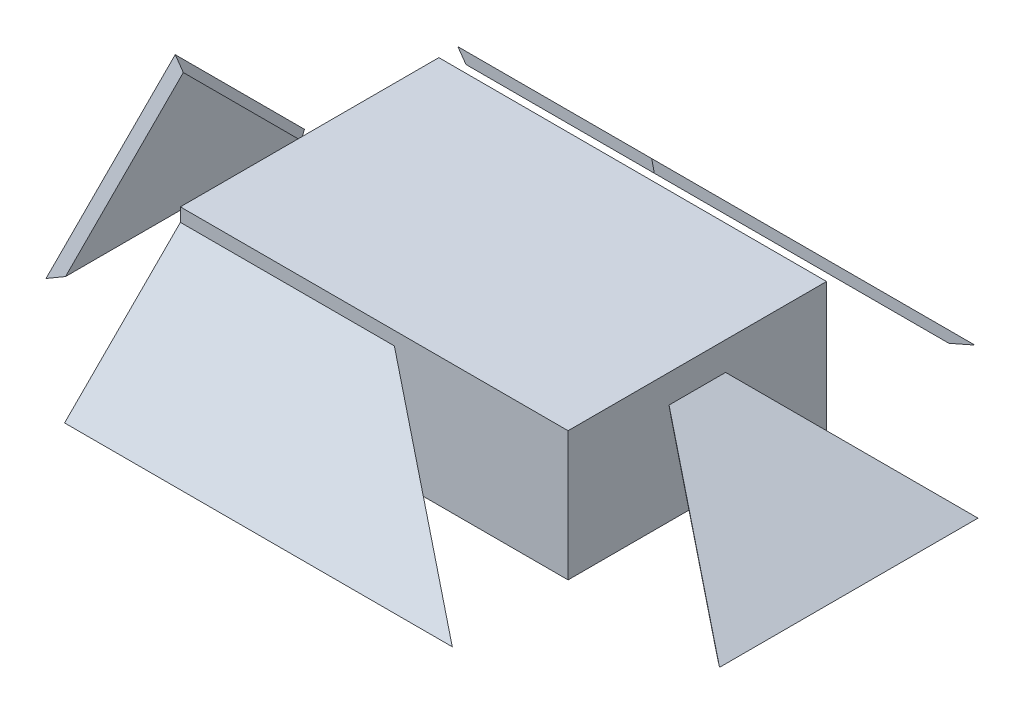
ISO-10303-21;
HEADER;
FILE_DESCRIPTION(('STEP AP214'),'2;1');
FILE_NAME('part.step','',(''),(''),'','','');
FILE_SCHEMA(('AUTOMOTIVE_DESIGN { 1 0 10303 214 1 1 1 1 }'));
ENDSEC;
DATA;
#1=APPLICATION_CONTEXT('core data for automotive mechanical design processes');
#2=APPLICATION_PROTOCOL_DEFINITION('international standard','automotive_design',2000,#1);
#3=PRODUCT_CONTEXT('',#1,'mechanical');
#4=PRODUCT('Part','Part','',(#3));
#5=PRODUCT_RELATED_PRODUCT_CATEGORY('part','',(#4));
#6=PRODUCT_DEFINITION_FORMATION('','',#4);
#7=PRODUCT_DEFINITION_CONTEXT('part definition',#1,'design');
#8=PRODUCT_DEFINITION('design','',#6,#7);
#9=PRODUCT_DEFINITION_SHAPE('','',#8);
#10=(LENGTH_UNIT() NAMED_UNIT(*) SI_UNIT(.MILLI.,.METRE.));
#11=(NAMED_UNIT(*) PLANE_ANGLE_UNIT() SI_UNIT($,.RADIAN.));
#12=(NAMED_UNIT(*) SI_UNIT($,.STERADIAN.) SOLID_ANGLE_UNIT());
#13=UNCERTAINTY_MEASURE_WITH_UNIT(LENGTH_MEASURE(1.E-05),#10,'distance_accuracy_value','');
#14=(GEOMETRIC_REPRESENTATION_CONTEXT(3) GLOBAL_UNCERTAINTY_ASSIGNED_CONTEXT((#13)) GLOBAL_UNIT_ASSIGNED_CONTEXT((#10,
#11,#12)) REPRESENTATION_CONTEXT('',''));
#15=CARTESIAN_POINT('',(0.,0.,0.));
#16=DIRECTION('',(0.,0.,1.));
#17=DIRECTION('',(1.,0.,0.));
#18=AXIS2_PLACEMENT_3D('',#15,#16,#17);
#19=CARTESIAN_POINT('',(67.8643239032383,-12.7,25.4));
#20=DIRECTION('',(-0.554700196225229,-0.832050294337843,0.));
#21=DIRECTION('',(-0.727606875108999,0.485071250072666,-0.485071250072666));
#22=AXIS2_PLACEMENT_3D('',#19,#20,#21);
#23=PLANE('',#22);
#24=DIRECTION('',(-0.727606875108999,0.485071250072666,-0.485071250072666));
#25=VECTOR('',#24,1.);
#26=CARTESIAN_POINT('',(67.8643239032383,-12.7,25.4));
#27=LINE('',#26,#25);
#28=CARTESIAN_POINT('',(67.8643239032383,-12.7,25.4));
#29=VERTEX_POINT('',#28);
#30=CARTESIAN_POINT('',(29.7643239032383,12.7,0.));
#31=VERTEX_POINT('',#30);
#32=EDGE_CURVE('E112',#29,#31,#27,.T.);
#33=ORIENTED_EDGE('',*,*,#32,.F.);
#34=DIRECTION('',(0.,0.,1.));
#35=VECTOR('',#34,1.);
#36=CARTESIAN_POINT('',(67.8643239032383,-12.7,0.));
#37=LINE('',#36,#35);
#38=CARTESIAN_POINT('',(67.8643239032383,-12.7,-25.4));
#39=VERTEX_POINT('',#38);
#40=EDGE_CURVE('E113',#39,#29,#37,.T.);
#41=ORIENTED_EDGE('',*,*,#40,.F.);
#42=DIRECTION('',(0.727606875108999,-0.485071250072666,-0.485071250072666));
#43=VECTOR('',#42,1.);
#44=CARTESIAN_POINT('',(29.7643239032383,12.7,0.));
#45=LINE('',#44,#43);
#46=EDGE_CURVE('E109',#31,#39,#45,.T.);
#47=ORIENTED_EDGE('',*,*,#46,.F.);
#48=EDGE_LOOP('',(#33,#41,#47));
#49=FACE_BOUND('',#48,.T.);
#50=ADVANCED_FACE('F71',(#49),#23,.F.);
#51=CARTESIAN_POINT('',(66.9837373417308,-14.0208798422613,25.4));
#52=DIRECTION('',(-0.554700196225229,-0.832050294337843,0.));
#53=DIRECTION('',(-0.727606875108999,0.485071250072666,-0.485071250072666));
#54=AXIS2_PLACEMENT_3D('',#51,#52,#53);
#55=PLANE('',#54);
#56=DIRECTION('',(-0.727606875108999,0.485071250072666,-0.485071250072666));
#57=VECTOR('',#56,1.);
#58=CARTESIAN_POINT('',(-8.89008000367885,36.5616650546785,-26.1067290849458));
#59=LINE('',#58,#57);
#60=CARTESIAN_POINT('',(65.0024175783388,-12.7,23.1549359697327));
#61=VERTEX_POINT('',#60);
#62=CARTESIAN_POINT('',(30.2700136237397,10.4549359697327,0.));
#63=VERTEX_POINT('',#62);
#64=EDGE_CURVE('E143',#61,#63,#59,.T.);
#65=ORIENTED_EDGE('',*,*,#64,.T.);
#66=DIRECTION('',(0.727606875108999,-0.485071250072666,-0.485071250072666));
#67=VECTOR('',#66,1.);
#68=CARTESIAN_POINT('',(49.3805082316152,-2.28539376885095,-12.7403297385837));
#69=LINE('',#68,#67);
#70=CARTESIAN_POINT('',(65.0024175783388,-12.7,-23.1549359697327));
#71=VERTEX_POINT('',#70);
#72=EDGE_CURVE('E82',#63,#71,#69,.T.);
#73=ORIENTED_EDGE('',*,*,#72,.T.);
#74=DIRECTION('',(0.,0.,1.));
#75=VECTOR('',#74,1.);
#76=CARTESIAN_POINT('',(65.0024175783388,-12.7,-25.4));
#77=LINE('',#76,#75);
#78=EDGE_CURVE('E13',#71,#61,#77,.T.);
#79=ORIENTED_EDGE('',*,*,#78,.T.);
#80=EDGE_LOOP('',(#65,#73,#79));
#81=FACE_BOUND('',#80,.T.);
#82=ADVANCED_FACE('F189',(#81),#55,.T.);
#83=CARTESIAN_POINT('',(35.4855499919242,-12.7000000000001,0.));
#84=DIRECTION('',(0.,-1.,0.));
#85=DIRECTION('',(0.,0.,-1.));
#86=AXIS2_PLACEMENT_3D('',#83,#84,#85);
#87=PLANE('',#86);
#88=DIRECTION('',(0.786795792469444,0.,-0.617213399848367));
#89=VECTOR('',#88,1.);
#90=CARTESIAN_POINT('',(65.0024175783388,-12.7,-23.1549359697327));
#91=LINE('',#90,#89);
#92=EDGE_CURVE('E103',#71,#39,#91,.T.);
#93=ORIENTED_EDGE('',*,*,#92,.T.);
#94=ORIENTED_EDGE('',*,*,#40,.T.);
#95=DIRECTION('',(0.786795792469442,0.,0.617213399848369));
#96=VECTOR('',#95,1.);
#97=CARTESIAN_POINT('',(65.0024175783388,-12.7,23.1549359697327));
#98=LINE('',#97,#96);
#99=EDGE_CURVE('E128',#61,#29,#98,.T.);
#100=ORIENTED_EDGE('',*,*,#99,.F.);
#101=ORIENTED_EDGE('',*,*,#78,.F.);
#102=EDGE_LOOP('',(#93,#94,#100,#101));
#103=FACE_BOUND('',#102,.T.);
#104=ADVANCED_FACE('F155',(#103),#87,.T.);
#105=CARTESIAN_POINT('',(35.4855499919244,-12.7,0.));
#106=DIRECTION('',(-0.611333817621871,-0.13769996008954,0.77930076634327));
#107=DIRECTION('',(0.786795792469442,0.,0.617213399848369));
#108=AXIS2_PLACEMENT_3D('',#105,#106,#107);
#109=PLANE('',#108);
#110=ORIENTED_EDGE('',*,*,#99,.T.);
#111=ORIENTED_EDGE('',*,*,#32,.T.);
#112=DIRECTION('',(-0.219739796968774,0.975558517787694,0.));
#113=VECTOR('',#112,1.);
#114=CARTESIAN_POINT('',(30.2700136237397,10.4549359697327,0.));
#115=LINE('',#114,#113);
#116=EDGE_CURVE('E118',#63,#31,#115,.T.);
#117=ORIENTED_EDGE('',*,*,#116,.F.);
#118=ORIENTED_EDGE('',*,*,#64,.F.);
#119=EDGE_LOOP('',(#110,#111,#117,#118));
#120=FACE_BOUND('',#119,.T.);
#121=ADVANCED_FACE('F126',(#120),#109,.T.);
#122=CARTESIAN_POINT('',(35.4855499919243,-12.6999999999999,-1.28369537222284E-13));
#123=DIRECTION('',(-0.61133381762187,-0.137699960089538,-0.779300766343272));
#124=DIRECTION('',(-0.786795792469443,0.,0.617213399848368));
#125=AXIS2_PLACEMENT_3D('',#122,#123,#124);
#126=PLANE('',#125);
#127=ORIENTED_EDGE('',*,*,#116,.T.);
#128=ORIENTED_EDGE('',*,*,#46,.T.);
#129=ORIENTED_EDGE('',*,*,#92,.F.);
#130=ORIENTED_EDGE('',*,*,#72,.F.);
#131=EDGE_LOOP('',(#127,#128,#129,#130));
#132=FACE_BOUND('',#131,.T.);
#133=ADVANCED_FACE('F132',(#132),#126,.T.);
#134=CLOSED_SHELL('',(#50,#82,#104,#121,#133));
#135=MANIFOLD_SOLID_BREP('B2',#134);
#136=CARTESIAN_POINT('',(-62.9212351803004,12.7,0.));
#137=DIRECTION('',(-1.,0.,0.));
#138=DIRECTION('',(0.,-0.707106781186547,-0.707106781186547));
#139=AXIS2_PLACEMENT_3D('',#136,#137,#138);
#140=PLANE('',#139);
#141=DIRECTION('',(0.,-0.707106781186548,-0.707106781186548));
#142=VECTOR('',#141,1.);
#143=CARTESIAN_POINT('',(-62.9212351803004,11.5774679848664,1.12253201513364));
#144=LINE('',#143,#142);
#145=CARTESIAN_POINT('',(-62.9212351803004,10.4549359697327,0.));
#146=VERTEX_POINT('',#145);
#147=CARTESIAN_POINT('',(-62.9212351803004,-12.7,-23.1549359697327));
#148=VERTEX_POINT('',#147);
#149=EDGE_CURVE('E357',#146,#148,#144,.T.);
#150=ORIENTED_EDGE('',*,*,#149,.F.);
#151=DIRECTION('',(0.,0.707106781186548,-0.707106781186548));
#152=VECTOR('',#151,1.);
#153=CARTESIAN_POINT('',(-62.9212351803004,36.9774679848664,-26.5225320151336));
#154=LINE('',#153,#152);
#155=CARTESIAN_POINT('',(-62.9212351803003,-12.7,23.1549359697327));
#156=VERTEX_POINT('',#155);
#157=EDGE_CURVE('E358',#156,#146,#154,.T.);
#158=ORIENTED_EDGE('',*,*,#157,.F.);
#159=DIRECTION('',(0.,0.,1.));
#160=VECTOR('',#159,1.);
#161=CARTESIAN_POINT('',(-62.9212351803004,-12.7,-25.4));
#162=LINE('',#161,#160);
#163=EDGE_CURVE('E354',#148,#156,#162,.T.);
#164=ORIENTED_EDGE('',*,*,#163,.F.);
#165=EDGE_LOOP('',(#150,#158,#164));
#166=FACE_BOUND('',#165,.T.);
#167=ADVANCED_FACE('F316',(#166),#140,.F.);
#168=CARTESIAN_POINT('',(-64.5087351803003,12.7,0.));
#169=DIRECTION('',(-1.,0.,0.));
#170=DIRECTION('',(0.,-0.707106781186547,-0.707106781186547));
#171=AXIS2_PLACEMENT_3D('',#168,#169,#170);
#172=PLANE('',#171);
#173=DIRECTION('',(0.,-0.707106781186548,-0.707106781186547));
#174=VECTOR('',#173,1.);
#175=CARTESIAN_POINT('',(-64.5087351803003,0.,-12.7));
#176=LINE('',#175,#174);
#177=CARTESIAN_POINT('',(-64.5087351803003,12.7,0.));
#178=VERTEX_POINT('',#177);
#179=CARTESIAN_POINT('',(-64.5087351803003,-12.7,-25.4));
#180=VERTEX_POINT('',#179);
#181=EDGE_CURVE('E379',#178,#180,#176,.T.);
#182=ORIENTED_EDGE('',*,*,#181,.T.);
#183=DIRECTION('',(0.,0.,1.));
#184=VECTOR('',#183,1.);
#185=CARTESIAN_POINT('',(-64.5087351803003,-12.7,0.));
#186=LINE('',#185,#184);
#187=CARTESIAN_POINT('',(-64.5087351803003,-12.7,25.4));
#188=VERTEX_POINT('',#187);
#189=EDGE_CURVE('E327',#180,#188,#186,.T.);
#190=ORIENTED_EDGE('',*,*,#189,.T.);
#191=DIRECTION('',(0.,0.707106781186547,-0.707106781186547));
#192=VECTOR('',#191,1.);
#193=CARTESIAN_POINT('',(-64.5087351803003,-12.7,25.4));
#194=LINE('',#193,#192);
#195=EDGE_CURVE('E69',#188,#178,#194,.T.);
#196=ORIENTED_EDGE('',*,*,#195,.T.);
#197=EDGE_LOOP('',(#182,#190,#196));
#198=FACE_BOUND('',#197,.T.);
#199=ADVANCED_FACE('F402',(#198),#172,.T.);
#200=CARTESIAN_POINT('',(-46.5482229381621,-12.6999999999999,0.));
#201=DIRECTION('',(-0.707106781186547,-0.500000000000001,0.5));
#202=DIRECTION('',(0.577350269189626,-0.816496580927725,0.));
#203=AXIS2_PLACEMENT_3D('',#200,#201,#202);
#204=PLANE('',#203);
#205=DIRECTION('',(0.577350269189626,-0.816496580927726,0.));
#206=VECTOR('',#205,1.);
#207=CARTESIAN_POINT('',(-64.5087351803003,12.7,0.));
#208=LINE('',#207,#206);
#209=EDGE_CURVE('E373',#178,#146,#208,.T.);
#210=ORIENTED_EDGE('',*,*,#209,.T.);
#211=ORIENTED_EDGE('',*,*,#149,.T.);
#212=DIRECTION('',(0.577350269189625,0.,0.816496580927726));
#213=VECTOR('',#212,1.);
#214=CARTESIAN_POINT('',(-64.5087351803003,-12.7,-25.4));
#215=LINE('',#214,#213);
#216=EDGE_CURVE('E371',#180,#148,#215,.T.);
#217=ORIENTED_EDGE('',*,*,#216,.F.);
#218=ORIENTED_EDGE('',*,*,#181,.F.);
#219=EDGE_LOOP('',(#210,#211,#217,#218));
#220=FACE_BOUND('',#219,.T.);
#221=ADVANCED_FACE('F370',(#220),#204,.F.);
#222=CARTESIAN_POINT('',(-46.5482229381618,-12.7,3.53883589099269E-13));
#223=DIRECTION('',(0.,1.,0.));
#224=DIRECTION('',(-1.,0.,0.));
#225=AXIS2_PLACEMENT_3D('',#222,#223,#224);
#226=PLANE('',#225);
#227=ORIENTED_EDGE('',*,*,#216,.T.);
#228=ORIENTED_EDGE('',*,*,#163,.T.);
#229=DIRECTION('',(0.577350269189636,0.,-0.816496580927719));
#230=VECTOR('',#229,1.);
#231=CARTESIAN_POINT('',(-64.5087351803003,-12.7,25.4));
#232=LINE('',#231,#230);
#233=EDGE_CURVE('E348',#188,#156,#232,.T.);
#234=ORIENTED_EDGE('',*,*,#233,.F.);
#235=ORIENTED_EDGE('',*,*,#189,.F.);
#236=EDGE_LOOP('',(#227,#228,#234,#235));
#237=FACE_BOUND('',#236,.T.);
#238=ADVANCED_FACE('F377',(#237),#226,.F.);
#239=CARTESIAN_POINT('',(-46.5482229381619,-12.7000000000002,0.));
#240=DIRECTION('',(-0.707106781186543,-0.499999999999997,-0.50000000000001));
#241=DIRECTION('',(-0.577350269189636,0.,0.816496580927719));
#242=AXIS2_PLACEMENT_3D('',#239,#240,#241);
#243=PLANE('',#242);
#244=ORIENTED_EDGE('',*,*,#233,.T.);
#245=ORIENTED_EDGE('',*,*,#157,.T.);
#246=ORIENTED_EDGE('',*,*,#209,.F.);
#247=ORIENTED_EDGE('',*,*,#195,.F.);
#248=EDGE_LOOP('',(#244,#245,#246,#247));
#249=FACE_BOUND('',#248,.T.);
#250=ADVANCED_FACE('F420',(#249),#243,.F.);
#251=CLOSED_SHELL('',(#167,#199,#221,#238,#250));
#252=MANIFOLD_SOLID_BREP('B7',#251);
#253=CARTESIAN_POINT('',(-38.1,-12.7,-54.5417582925164));
#254=DIRECTION('',(0.,0.707106781186547,-0.707106781186547));
#255=DIRECTION('',(0.,0.707106781186548,0.707106781186548));
#256=AXIS2_PLACEMENT_3D('',#253,#254,#255);
#257=PLANE('',#256);
#258=DIRECTION('',(0.,-0.707106781186548,-0.707106781186547));
#259=VECTOR('',#258,1.);
#260=CARTESIAN_POINT('',(-38.1,0.,-41.8417582925164));
#261=LINE('',#260,#259);
#262=CARTESIAN_POINT('',(-38.1,12.7,-29.1417582925164));
#263=VERTEX_POINT('',#262);
#264=CARTESIAN_POINT('',(-38.1,-12.7,-54.5417582925164));
#265=VERTEX_POINT('',#264);
#266=EDGE_CURVE('E610',#263,#265,#261,.T.);
#267=ORIENTED_EDGE('',*,*,#266,.F.);
#268=DIRECTION('',(1.,0.,0.));
#269=VECTOR('',#268,1.);
#270=CARTESIAN_POINT('',(-38.1,12.7,-29.1417582925164));
#271=LINE('',#270,#269);
#272=CARTESIAN_POINT('',(0.,12.7,-29.1417582925164));
#273=VERTEX_POINT('',#272);
#274=EDGE_CURVE('E628',#263,#273,#271,.T.);
#275=ORIENTED_EDGE('',*,*,#274,.T.);
#276=DIRECTION('',(0.727606875108999,-0.485071250072666,-0.485071250072666));
#277=VECTOR('',#276,1.);
#278=CARTESIAN_POINT('',(0.,12.7,-29.1417582925164));
#279=LINE('',#278,#277);
#280=CARTESIAN_POINT('',(38.1,-12.7,-54.5417582925164));
#281=VERTEX_POINT('',#280);
#282=EDGE_CURVE('E611',#273,#281,#279,.T.);
#283=ORIENTED_EDGE('',*,*,#282,.T.);
#284=DIRECTION('',(-1.,0.,0.));
#285=VECTOR('',#284,1.);
#286=CARTESIAN_POINT('',(-38.1,-12.7,-54.5417582925164));
#287=LINE('',#286,#285);
#288=EDGE_CURVE('E606',#281,#265,#287,.T.);
#289=ORIENTED_EDGE('',*,*,#288,.T.);
#290=EDGE_LOOP('',(#267,#275,#283,#289));
#291=FACE_BOUND('',#290,.T.);
#292=ADVANCED_FACE('F561',(#291),#257,.T.);
#293=CARTESIAN_POINT('',(-38.1,-13.8225320151336,-53.4192262773827));
#294=DIRECTION('',(0.,0.707106781186547,-0.707106781186547));
#295=DIRECTION('',(0.,0.707106781186548,0.707106781186548));
#296=AXIS2_PLACEMENT_3D('',#293,#294,#295);
#297=PLANE('',#296);
#298=DIRECTION('',(0.,-0.707106781186548,-0.707106781186548));
#299=VECTOR('',#298,1.);
#300=CARTESIAN_POINT('',(-36.5125,11.5774679848664,-28.0192262773827));
#301=LINE('',#300,#299);
#302=CARTESIAN_POINT('',(-36.5125,10.4549359697327,-29.1417582925164));
#303=VERTEX_POINT('',#302);
#304=CARTESIAN_POINT('',(-36.5125,-12.7,-52.2966942622491));
#305=VERTEX_POINT('',#304);
#306=EDGE_CURVE('E637',#303,#305,#301,.T.);
#307=ORIENTED_EDGE('',*,*,#306,.T.);
#308=DIRECTION('',(-1.,0.,0.));
#309=VECTOR('',#308,1.);
#310=CARTESIAN_POINT('',(-38.1,-12.7,-52.2966942622491));
#311=LINE('',#310,#309);
#312=CARTESIAN_POINT('',(35.2380936751004,-12.7,-52.2966942622491));
#313=VERTEX_POINT('',#312);
#314=EDGE_CURVE('E634',#313,#305,#311,.T.);
#315=ORIENTED_EDGE('',*,*,#314,.F.);
#316=DIRECTION('',(0.727606875108999,-0.485071250072666,-0.485071250072666));
#317=VECTOR('',#316,1.);
#318=CARTESIAN_POINT('',(19.6161843283769,-2.28539376885095,-41.8820880311));
#319=LINE('',#318,#317);
#320=CARTESIAN_POINT('',(0.505689720501403,10.4549359697327,-29.1417582925164));
#321=VERTEX_POINT('',#320);
#322=EDGE_CURVE('E572',#321,#313,#319,.T.);
#323=ORIENTED_EDGE('',*,*,#322,.F.);
#324=DIRECTION('',(1.,0.,0.));
#325=VECTOR('',#324,1.);
#326=CARTESIAN_POINT('',(-38.1,10.4549359697327,-29.1417582925164));
#327=LINE('',#326,#325);
#328=EDGE_CURVE('E314',#303,#321,#327,.T.);
#329=ORIENTED_EDGE('',*,*,#328,.F.);
#330=EDGE_LOOP('',(#307,#315,#323,#329));
#331=FACE_BOUND('',#330,.T.);
#332=ADVANCED_FACE('F705',(#331),#297,.F.);
#333=CARTESIAN_POINT('',(-10.9126650688098,-12.6999999999998,-16.0930605080474));
#334=DIRECTION('',(0.,-1.,0.));
#335=DIRECTION('',(0.,0.,-1.));
#336=AXIS2_PLACEMENT_3D('',#333,#334,#335);
#337=PLANE('',#336);
#338=DIRECTION('',(-0.577350269189625,0.,-0.816496580927726));
#339=VECTOR('',#338,1.);
#340=CARTESIAN_POINT('',(-36.5125,-12.7,-52.2966942622491));
#341=LINE('',#340,#339);
#342=EDGE_CURVE('E625',#305,#265,#341,.T.);
#343=ORIENTED_EDGE('',*,*,#342,.T.);
#344=ORIENTED_EDGE('',*,*,#288,.F.);
#345=DIRECTION('',(0.786795792469444,0.,-0.617213399848367));
#346=VECTOR('',#345,1.);
#347=CARTESIAN_POINT('',(35.2380936751004,-12.7,-52.2966942622491));
#348=LINE('',#347,#346);
#349=EDGE_CURVE('E600',#313,#281,#348,.T.);
#350=ORIENTED_EDGE('',*,*,#349,.F.);
#351=ORIENTED_EDGE('',*,*,#314,.T.);
#352=EDGE_LOOP('',(#343,#344,#350,#351));
#353=FACE_BOUND('',#352,.T.);
#354=ADVANCED_FACE('F632',(#353),#337,.T.);
#355=CARTESIAN_POINT('',(5.72122608868601,-12.6999999999999,-29.1417582925164));
#356=DIRECTION('',(0.61133381762187,0.137699960089538,0.779300766343272));
#357=DIRECTION('',(0.786795792469443,0.,-0.617213399848368));
#358=AXIS2_PLACEMENT_3D('',#355,#356,#357);
#359=PLANE('',#358);
#360=ORIENTED_EDGE('',*,*,#349,.T.);
#361=ORIENTED_EDGE('',*,*,#282,.F.);
#362=DIRECTION('',(-0.219739796968774,0.975558517787694,0.));
#363=VECTOR('',#362,1.);
#364=CARTESIAN_POINT('',(0.505689720501403,10.4549359697327,-29.1417582925164));
#365=LINE('',#364,#363);
#366=EDGE_CURVE('E616',#321,#273,#365,.T.);
#367=ORIENTED_EDGE('',*,*,#366,.F.);
#368=ORIENTED_EDGE('',*,*,#322,.T.);
#369=EDGE_LOOP('',(#360,#361,#367,#368));
#370=FACE_BOUND('',#369,.T.);
#371=ADVANCED_FACE('F660',(#370),#359,.T.);
#372=CARTESIAN_POINT('',(-20.1394877578617,-12.6999999999999,-29.1417582925164));
#373=DIRECTION('',(-0.707106781186547,-0.500000000000001,0.5));
#374=DIRECTION('',(0.577350269189626,-0.816496580927725,0.));
#375=AXIS2_PLACEMENT_3D('',#372,#373,#374);
#376=PLANE('',#375);
#377=DIRECTION('',(-0.577350269189626,0.816496580927726,0.));
#378=VECTOR('',#377,1.);
#379=CARTESIAN_POINT('',(-36.5125,10.4549359697327,-29.1417582925164));
#380=LINE('',#379,#378);
#381=EDGE_CURVE('E627',#303,#263,#380,.T.);
#382=ORIENTED_EDGE('',*,*,#381,.T.);
#383=ORIENTED_EDGE('',*,*,#266,.T.);
#384=ORIENTED_EDGE('',*,*,#342,.F.);
#385=ORIENTED_EDGE('',*,*,#306,.F.);
#386=EDGE_LOOP('',(#382,#383,#384,#385));
#387=FACE_BOUND('',#386,.T.);
#388=ADVANCED_FACE('F624',(#387),#376,.T.);
#389=CARTESIAN_POINT('',(0.,12.7,-29.1417582925164));
#390=DIRECTION('',(0.,0.,-1.));
#391=DIRECTION('',(0.,1.,0.));
#392=AXIS2_PLACEMENT_3D('',#389,#390,#391);
#393=PLANE('',#392);
#394=ORIENTED_EDGE('',*,*,#366,.T.);
#395=ORIENTED_EDGE('',*,*,#274,.F.);
#396=ORIENTED_EDGE('',*,*,#381,.F.);
#397=ORIENTED_EDGE('',*,*,#328,.T.);
#398=EDGE_LOOP('',(#394,#395,#396,#397));
#399=FACE_BOUND('',#398,.T.);
#400=ADVANCED_FACE('F659',(#399),#393,.F.);
#401=CLOSED_SHELL('',(#292,#332,#354,#371,#388,#400));
#402=MANIFOLD_SOLID_BREP('B63',#401);
#403=CARTESIAN_POINT('',(-38.1,38.1,-2.64020842985895));
#404=DIRECTION('',(0.,-0.707106781186548,-0.707106781186548));
#405=DIRECTION('',(0.,0.707106781186548,-0.707106781186548));
#406=AXIS2_PLACEMENT_3D('',#403,#404,#405);
#407=PLANE('',#406);
#408=DIRECTION('',(-0.727606875108999,0.485071250072666,-0.485071250072666));
#409=VECTOR('',#408,1.);
#410=CARTESIAN_POINT('',(38.1,-12.7,48.1597915701411));
#411=LINE('',#410,#409);
#412=CARTESIAN_POINT('',(38.1,-12.7,48.1597915701411));
#413=VERTEX_POINT('',#412);
#414=CARTESIAN_POINT('',(0.,12.7,22.7597915701411));
#415=VERTEX_POINT('',#414);
#416=EDGE_CURVE('E927',#413,#415,#411,.T.);
#417=ORIENTED_EDGE('',*,*,#416,.T.);
#418=DIRECTION('',(1.,0.,0.));
#419=VECTOR('',#418,1.);
#420=CARTESIAN_POINT('',(-38.1,12.7,22.7597915701411));
#421=LINE('',#420,#419);
#422=CARTESIAN_POINT('',(-38.1,12.7,22.7597915701411));
#423=VERTEX_POINT('',#422);
#424=EDGE_CURVE('E944',#423,#415,#421,.T.);
#425=ORIENTED_EDGE('',*,*,#424,.F.);
#426=DIRECTION('',(0.,0.707106781186547,-0.707106781186547));
#427=VECTOR('',#426,1.);
#428=CARTESIAN_POINT('',(-38.1,-12.7,48.1597915701411));
#429=LINE('',#428,#427);
#430=CARTESIAN_POINT('',(-38.1,-12.7,48.1597915701411));
#431=VERTEX_POINT('',#430);
#432=EDGE_CURVE('E928',#431,#423,#429,.T.);
#433=ORIENTED_EDGE('',*,*,#432,.F.);
#434=DIRECTION('',(1.,0.,0.));
#435=VECTOR('',#434,1.);
#436=CARTESIAN_POINT('',(-38.1,-12.7,48.1597915701411));
#437=LINE('',#436,#435);
#438=EDGE_CURVE('E923',#431,#413,#437,.T.);
#439=ORIENTED_EDGE('',*,*,#438,.T.);
#440=EDGE_LOOP('',(#417,#425,#433,#439));
#441=FACE_BOUND('',#440,.T.);
#442=ADVANCED_FACE('F878',(#441),#407,.F.);
#443=CARTESIAN_POINT('',(-38.1,36.9774679848664,-3.76274044499259));
#444=DIRECTION('',(0.,-0.707106781186548,-0.707106781186548));
#445=DIRECTION('',(0.,0.707106781186548,-0.707106781186548));
#446=AXIS2_PLACEMENT_3D('',#443,#444,#445);
#447=PLANE('',#446);
#448=DIRECTION('',(-0.727606875108999,0.485071250072666,-0.485071250072666));
#449=VECTOR('',#448,1.);
#450=CARTESIAN_POINT('',(-38.6544039069172,36.5616650546785,-3.34693751480469));
#451=LINE('',#450,#449);
#452=CARTESIAN_POINT('',(35.2380936751005,-12.7,45.9147275398738));
#453=VERTEX_POINT('',#452);
#454=CARTESIAN_POINT('',(0.505689720501403,10.4549359697327,22.7597915701411));
#455=VERTEX_POINT('',#454);
#456=EDGE_CURVE('E952',#453,#455,#451,.T.);
#457=ORIENTED_EDGE('',*,*,#456,.F.);
#458=DIRECTION('',(1.,0.,0.));
#459=VECTOR('',#458,1.);
#460=CARTESIAN_POINT('',(-38.1,-12.7,45.9147275398738));
#461=LINE('',#460,#459);
#462=CARTESIAN_POINT('',(-36.5125,-12.7,45.9147275398738));
#463=VERTEX_POINT('',#462);
#464=EDGE_CURVE('E950',#463,#453,#461,.T.);
#465=ORIENTED_EDGE('',*,*,#464,.F.);
#466=DIRECTION('',(0.,0.707106781186548,-0.707106781186548));
#467=VECTOR('',#466,1.);
#468=CARTESIAN_POINT('',(-36.5125,36.9774679848664,-3.76274044499259));
#469=LINE('',#468,#467);
#470=CARTESIAN_POINT('',(-36.5125,10.4549359697327,22.7597915701411));
#471=VERTEX_POINT('',#470);
#472=EDGE_CURVE('E889',#463,#471,#469,.T.);
#473=ORIENTED_EDGE('',*,*,#472,.T.);
#474=DIRECTION('',(1.,0.,0.));
#475=VECTOR('',#474,1.);
#476=CARTESIAN_POINT('',(-38.1,10.4549359697327,22.7597915701411));
#477=LINE('',#476,#475);
#478=EDGE_CURVE('E559',#471,#455,#477,.T.);
#479=ORIENTED_EDGE('',*,*,#478,.T.);
#480=EDGE_LOOP('',(#457,#465,#473,#479));
#481=FACE_BOUND('',#480,.T.);
#482=ADVANCED_FACE('F976',(#481),#447,.T.);
#483=CARTESIAN_POINT('',(5.72122608868599,-12.7000000000001,22.7597915701411));
#484=DIRECTION('',(0.611333817621871,0.13769996008954,-0.77930076634327));
#485=DIRECTION('',(-0.786795792469442,0.,-0.617213399848369));
#486=AXIS2_PLACEMENT_3D('',#483,#484,#485);
#487=PLANE('',#486);
#488=DIRECTION('',(-0.219739796968774,0.975558517787694,0.));
#489=VECTOR('',#488,1.);
#490=CARTESIAN_POINT('',(0.505689720501403,10.4549359697327,22.7597915701411));
#491=LINE('',#490,#489);
#492=EDGE_CURVE('E943',#455,#415,#491,.T.);
#493=ORIENTED_EDGE('',*,*,#492,.T.);
#494=ORIENTED_EDGE('',*,*,#416,.F.);
#495=DIRECTION('',(0.786795792469442,0.,0.617213399848369));
#496=VECTOR('',#495,1.);
#497=CARTESIAN_POINT('',(35.2380936751004,-12.7,45.9147275398738));
#498=LINE('',#497,#496);
#499=EDGE_CURVE('E941',#453,#413,#498,.T.);
#500=ORIENTED_EDGE('',*,*,#499,.F.);
#501=ORIENTED_EDGE('',*,*,#456,.T.);
#502=EDGE_LOOP('',(#493,#494,#500,#501));
#503=FACE_BOUND('',#502,.T.);
#504=ADVANCED_FACE('F940',(#503),#487,.T.);
#505=CARTESIAN_POINT('',(-10.9126650688093,-12.7,9.71109378567232));
#506=DIRECTION('',(0.,-1.,0.));
#507=DIRECTION('',(1.,0.,0.));
#508=AXIS2_PLACEMENT_3D('',#505,#506,#507);
#509=PLANE('',#508);
#510=ORIENTED_EDGE('',*,*,#499,.T.);
#511=ORIENTED_EDGE('',*,*,#438,.F.);
#512=DIRECTION('',(-0.577350269189636,0.,0.816496580927719));
#513=VECTOR('',#512,1.);
#514=CARTESIAN_POINT('',(-36.5125,-12.7,45.9147275398738));
#515=LINE('',#514,#513);
#516=EDGE_CURVE('E917',#463,#431,#515,.T.);
#517=ORIENTED_EDGE('',*,*,#516,.F.);
#518=ORIENTED_EDGE('',*,*,#464,.T.);
#519=EDGE_LOOP('',(#510,#511,#517,#518));
#520=FACE_BOUND('',#519,.T.);
#521=ADVANCED_FACE('F948',(#520),#509,.T.);
#522=CARTESIAN_POINT('',(-38.1,12.7,22.7597915701411));
#523=DIRECTION('',(0.,0.,-1.));
#524=DIRECTION('',(0.,1.,0.));
#525=AXIS2_PLACEMENT_3D('',#522,#523,#524);
#526=PLANE('',#525);
#527=DIRECTION('',(-0.577350269189626,0.816496580927726,0.));
#528=VECTOR('',#527,1.);
#529=CARTESIAN_POINT('',(-36.5125,10.4549359697327,22.7597915701411));
#530=LINE('',#529,#528);
#531=EDGE_CURVE('E955',#471,#423,#530,.T.);
#532=ORIENTED_EDGE('',*,*,#531,.T.);
#533=ORIENTED_EDGE('',*,*,#424,.T.);
#534=ORIENTED_EDGE('',*,*,#492,.F.);
#535=ORIENTED_EDGE('',*,*,#478,.F.);
#536=EDGE_LOOP('',(#532,#533,#534,#535));
#537=FACE_BOUND('',#536,.T.);
#538=ADVANCED_FACE('F996',(#537),#526,.T.);
#539=CARTESIAN_POINT('',(-20.1394877578616,-12.7000000000002,22.759791570141));
#540=DIRECTION('',(-0.707106781186543,-0.499999999999997,-0.50000000000001));
#541=DIRECTION('',(-0.577350269189636,0.,0.816496580927719));
#542=AXIS2_PLACEMENT_3D('',#539,#540,#541);
#543=PLANE('',#542);
#544=ORIENTED_EDGE('',*,*,#516,.T.);
#545=ORIENTED_EDGE('',*,*,#432,.T.);
#546=ORIENTED_EDGE('',*,*,#531,.F.);
#547=ORIENTED_EDGE('',*,*,#472,.F.);
#548=EDGE_LOOP('',(#544,#545,#546,#547));
#549=FACE_BOUND('',#548,.T.);
#550=ADVANCED_FACE('F1004',(#549),#543,.T.);
#551=CLOSED_SHELL('',(#442,#482,#504,#521,#538,#550));
#552=MANIFOLD_SOLID_BREP('B308',#551);
#553=CARTESIAN_POINT('',(38.1,-12.7,25.4));
#554=DIRECTION('',(-0.554700196225229,-0.832050294337843,0.));
#555=DIRECTION('',(-0.727606875108999,0.485071250072666,-0.485071250072666));
#556=AXIS2_PLACEMENT_3D('',#553,#554,#555);
#557=PLANE('',#556);
#558=DIRECTION('',(-0.727606875108999,0.485071250072666,-0.485071250072666));
#559=VECTOR('',#558,1.);
#560=CARTESIAN_POINT('',(38.1,-12.7,25.4));
#561=LINE('',#560,#559);
#562=CARTESIAN_POINT('',(38.1,-12.7,25.4));
#563=VERTEX_POINT('',#562);
#564=CARTESIAN_POINT('',(0.,12.7,0.));
#565=VERTEX_POINT('',#564);
#566=EDGE_CURVE('E1304',#563,#565,#561,.T.);
#567=ORIENTED_EDGE('',*,*,#566,.F.);
#568=DIRECTION('',(0.,0.,1.));
#569=VECTOR('',#568,1.);
#570=CARTESIAN_POINT('',(38.1,-12.7,0.));
#571=LINE('',#570,#569);
#572=CARTESIAN_POINT('',(38.1,-12.7,-25.4));
#573=VERTEX_POINT('',#572);
#574=EDGE_CURVE('E1308',#573,#563,#571,.T.);
#575=ORIENTED_EDGE('',*,*,#574,.F.);
#576=DIRECTION('',(0.727606875108999,-0.485071250072666,-0.485071250072666));
#577=VECTOR('',#576,1.);
#578=CARTESIAN_POINT('',(0.,12.7,0.));
#579=LINE('',#578,#577);
#580=EDGE_CURVE('E1197',#565,#573,#579,.T.);
#581=ORIENTED_EDGE('',*,*,#580,.F.);
#582=EDGE_LOOP('',(#567,#575,#581));
#583=FACE_BOUND('',#582,.T.);
#584=ADVANCED_FACE('F1194',(#583),#557,.F.);
#585=CARTESIAN_POINT('',(-38.1,-12.7,-25.4));
#586=DIRECTION('',(0.,0.707106781186547,-0.707106781186547));
#587=DIRECTION('',(0.,0.707106781186548,0.707106781186548));
#588=AXIS2_PLACEMENT_3D('',#585,#586,#587);
#589=PLANE('',#588);
#590=DIRECTION('',(0.,-0.707106781186548,-0.707106781186547));
#591=VECTOR('',#590,1.);
#592=CARTESIAN_POINT('',(-38.1,0.,-12.7));
#593=LINE('',#592,#591);
#594=CARTESIAN_POINT('',(-38.1,12.7,0.));
#595=VERTEX_POINT('',#594);
#596=CARTESIAN_POINT('',(-38.1,-12.7,-25.4));
#597=VERTEX_POINT('',#596);
#598=EDGE_CURVE('E1312',#595,#597,#593,.T.);
#599=ORIENTED_EDGE('',*,*,#598,.F.);
#600=DIRECTION('',(1.,0.,0.));
#601=VECTOR('',#600,1.);
#602=CARTESIAN_POINT('',(-38.1,12.7,0.));
#603=LINE('',#602,#601);
#604=EDGE_CURVE('E1301',#595,#565,#603,.T.);
#605=ORIENTED_EDGE('',*,*,#604,.T.);
#606=ORIENTED_EDGE('',*,*,#580,.T.);
#607=DIRECTION('',(-1.,0.,0.));
#608=VECTOR('',#607,1.);
#609=CARTESIAN_POINT('',(-38.1,-12.7,-25.4));
#610=LINE('',#609,#608);
#611=EDGE_CURVE('E1309',#573,#597,#610,.T.);
#612=ORIENTED_EDGE('',*,*,#611,.T.);
#613=EDGE_LOOP('',(#599,#605,#606,#612));
#614=FACE_BOUND('',#613,.T.);
#615=ADVANCED_FACE('F1406',(#614),#589,.T.);
#616=CARTESIAN_POINT('',(-38.1,12.7,0.));
#617=DIRECTION('',(-1.,0.,0.));
#618=DIRECTION('',(0.,-0.707106781186547,-0.707106781186547));
#619=AXIS2_PLACEMENT_3D('',#616,#617,#618);
#620=PLANE('',#619);
#621=ORIENTED_EDGE('',*,*,#598,.T.);
#622=DIRECTION('',(0.,0.,1.));
#623=VECTOR('',#622,1.);
#624=CARTESIAN_POINT('',(-38.1,-12.7,0.));
#625=LINE('',#624,#623);
#626=CARTESIAN_POINT('',(-38.1,-12.7,25.4));
#627=VERTEX_POINT('',#626);
#628=EDGE_CURVE('E1238',#597,#627,#625,.T.);
#629=ORIENTED_EDGE('',*,*,#628,.T.);
#630=DIRECTION('',(0.,0.707106781186547,-0.707106781186547));
#631=VECTOR('',#630,1.);
#632=CARTESIAN_POINT('',(-38.1,-12.7,25.4));
#633=LINE('',#632,#631);
#634=EDGE_CURVE('E1203',#627,#595,#633,.T.);
#635=ORIENTED_EDGE('',*,*,#634,.T.);
#636=EDGE_LOOP('',(#621,#629,#635));
#637=FACE_BOUND('',#636,.T.);
#638=ADVANCED_FACE('F1398',(#637),#620,.T.);
#639=CARTESIAN_POINT('',(-38.1,-12.7,-25.4));
#640=DIRECTION('',(0.,1.,0.));
#641=DIRECTION('',(0.,0.,1.));
#642=AXIS2_PLACEMENT_3D('',#639,#640,#641);
#643=PLANE('',#642);
#644=DIRECTION('',(0.,0.,1.));
#645=VECTOR('',#644,1.);
#646=CARTESIAN_POINT('',(35.2380936751004,-12.7,-25.4));
#647=LINE('',#646,#645);
#648=CARTESIAN_POINT('',(35.2380936751004,-12.7,-23.1549359697327));
#649=VERTEX_POINT('',#648);
#650=CARTESIAN_POINT('',(35.2380936751004,-12.7,23.1549359697327));
#651=VERTEX_POINT('',#650);
#652=EDGE_CURVE('E1275',#649,#651,#647,.T.);
#653=ORIENTED_EDGE('',*,*,#652,.F.);
#654=DIRECTION('',(-1.,0.,0.));
#655=VECTOR('',#654,1.);
#656=CARTESIAN_POINT('',(-38.1,-12.7,-23.1549359697327));
#657=LINE('',#656,#655);
#658=CARTESIAN_POINT('',(-36.5125,-12.7,-23.1549359697327));
#659=VERTEX_POINT('',#658);
#660=EDGE_CURVE('E1261',#649,#659,#657,.T.);
#661=ORIENTED_EDGE('',*,*,#660,.T.);
#662=DIRECTION('',(0.,0.,1.));
#663=VECTOR('',#662,1.);
#664=CARTESIAN_POINT('',(-36.5125,-12.7,-25.4));
#665=LINE('',#664,#663);
#666=CARTESIAN_POINT('',(-36.5125,-12.7,23.1549359697327));
#667=VERTEX_POINT('',#666);
#668=EDGE_CURVE('E1284',#659,#667,#665,.T.);
#669=ORIENTED_EDGE('',*,*,#668,.T.);
#670=DIRECTION('',(1.,0.,0.));
#671=VECTOR('',#670,1.);
#672=CARTESIAN_POINT('',(-38.1,-12.7,23.1549359697327));
#673=LINE('',#672,#671);
#674=EDGE_CURVE('E1290',#667,#651,#673,.T.);
#675=ORIENTED_EDGE('',*,*,#674,.T.);
#676=EDGE_LOOP('',(#653,#661,#669,#675));
#677=FACE_BOUND('',#676,.T.);
#678=ORIENTED_EDGE('',*,*,#611,.F.);
#679=ORIENTED_EDGE('',*,*,#574,.T.);
#680=DIRECTION('',(1.,0.,0.));
#681=VECTOR('',#680,1.);
#682=CARTESIAN_POINT('',(-38.1,-12.7,25.4));
#683=LINE('',#682,#681);
#684=EDGE_CURVE('E876',#627,#563,#683,.T.);
#685=ORIENTED_EDGE('',*,*,#684,.F.);
#686=ORIENTED_EDGE('',*,*,#628,.F.);
#687=EDGE_LOOP('',(#678,#679,#685,#686));
#688=FACE_BOUND('',#687,.T.);
#689=ADVANCED_FACE('F1403',(#677,#688),#643,.F.);
#690=CARTESIAN_POINT('',(-38.1,38.1,-25.4));
#691=DIRECTION('',(0.,-0.707106781186548,-0.707106781186548));
#692=DIRECTION('',(0.,0.707106781186548,-0.707106781186548));
#693=AXIS2_PLACEMENT_3D('',#690,#691,#692);
#694=PLANE('',#693);
#695=ORIENTED_EDGE('',*,*,#566,.T.);
#696=ORIENTED_EDGE('',*,*,#604,.F.);
#697=ORIENTED_EDGE('',*,*,#634,.F.);
#698=ORIENTED_EDGE('',*,*,#684,.T.);
#699=EDGE_LOOP('',(#695,#696,#697,#698));
#700=FACE_BOUND('',#699,.T.);
#701=ADVANCED_FACE('F1405',(#700),#694,.F.);
#702=CARTESIAN_POINT('',(37.2194134384924,-14.0208798422613,25.4));
#703=DIRECTION('',(-0.554700196225229,-0.832050294337843,0.));
#704=DIRECTION('',(-0.727606875108999,0.485071250072666,-0.485071250072666));
#705=AXIS2_PLACEMENT_3D('',#702,#703,#704);
#706=PLANE('',#705);
#707=DIRECTION('',(-0.727606875108999,0.485071250072666,-0.485071250072666));
#708=VECTOR('',#707,1.);
#709=CARTESIAN_POINT('',(-38.6544039069172,36.5616650546785,-26.1067290849458));
#710=LINE('',#709,#708);
#711=CARTESIAN_POINT('',(0.505689720501403,10.4549359697327,0.));
#712=VERTEX_POINT('',#711);
#713=EDGE_CURVE('E1271',#651,#712,#710,.T.);
#714=ORIENTED_EDGE('',*,*,#713,.T.);
#715=DIRECTION('',(0.727606875108999,-0.485071250072666,-0.485071250072666));
#716=VECTOR('',#715,1.);
#717=CARTESIAN_POINT('',(19.6161843283769,-2.28539376885095,-12.7403297385837));
#718=LINE('',#717,#716);
#719=EDGE_CURVE('E1256',#712,#649,#718,.T.);
#720=ORIENTED_EDGE('',*,*,#719,.T.);
#721=ORIENTED_EDGE('',*,*,#652,.T.);
#722=EDGE_LOOP('',(#714,#720,#721));
#723=FACE_BOUND('',#722,.T.);
#724=ADVANCED_FACE('F1274',(#723),#706,.T.);
#725=CARTESIAN_POINT('',(-38.1,-13.8225320151336,-24.2774679848664));
#726=DIRECTION('',(0.,0.707106781186547,-0.707106781186547));
#727=DIRECTION('',(0.,0.707106781186548,0.707106781186548));
#728=AXIS2_PLACEMENT_3D('',#725,#726,#727);
#729=PLANE('',#728);
#730=DIRECTION('',(0.,-0.707106781186548,-0.707106781186548));
#731=VECTOR('',#730,1.);
#732=CARTESIAN_POINT('',(-36.5125,11.5774679848664,1.12253201513364));
#733=LINE('',#732,#731);
#734=CARTESIAN_POINT('',(-36.5125,10.4549359697327,0.));
#735=VERTEX_POINT('',#734);
#736=EDGE_CURVE('E1267',#735,#659,#733,.T.);
#737=ORIENTED_EDGE('',*,*,#736,.T.);
#738=ORIENTED_EDGE('',*,*,#660,.F.);
#739=ORIENTED_EDGE('',*,*,#719,.F.);
#740=DIRECTION('',(1.,0.,0.));
#741=VECTOR('',#740,1.);
#742=CARTESIAN_POINT('',(-38.1,10.4549359697327,0.));
#743=LINE('',#742,#741);
#744=EDGE_CURVE('E1259',#735,#712,#743,.T.);
#745=ORIENTED_EDGE('',*,*,#744,.F.);
#746=EDGE_LOOP('',(#737,#738,#739,#745));
#747=FACE_BOUND('',#746,.T.);
#748=ADVANCED_FACE('F1258',(#747),#729,.F.);
#749=CARTESIAN_POINT('',(-36.5125,12.7,0.));
#750=DIRECTION('',(-1.,0.,0.));
#751=DIRECTION('',(0.,-0.707106781186547,-0.707106781186547));
#752=AXIS2_PLACEMENT_3D('',#749,#750,#751);
#753=PLANE('',#752);
#754=ORIENTED_EDGE('',*,*,#736,.F.);
#755=DIRECTION('',(0.,0.707106781186548,-0.707106781186548));
#756=VECTOR('',#755,1.);
#757=CARTESIAN_POINT('',(-36.5125,36.9774679848664,-26.5225320151336));
#758=LINE('',#757,#756);
#759=EDGE_CURVE('E1211',#667,#735,#758,.T.);
#760=ORIENTED_EDGE('',*,*,#759,.F.);
#761=ORIENTED_EDGE('',*,*,#668,.F.);
#762=EDGE_LOOP('',(#754,#760,#761));
#763=FACE_BOUND('',#762,.T.);
#764=ADVANCED_FACE('F1425',(#763),#753,.F.);
#765=CARTESIAN_POINT('',(-38.1,36.9774679848664,-26.5225320151336));
#766=DIRECTION('',(0.,-0.707106781186548,-0.707106781186548));
#767=DIRECTION('',(0.,0.707106781186548,-0.707106781186548));
#768=AXIS2_PLACEMENT_3D('',#765,#766,#767);
#769=PLANE('',#768);
#770=ORIENTED_EDGE('',*,*,#713,.F.);
#771=ORIENTED_EDGE('',*,*,#674,.F.);
#772=ORIENTED_EDGE('',*,*,#759,.T.);
#773=ORIENTED_EDGE('',*,*,#744,.T.);
#774=EDGE_LOOP('',(#770,#771,#772,#773));
#775=FACE_BOUND('',#774,.T.);
#776=ADVANCED_FACE('F1270',(#775),#769,.T.);
#777=CLOSED_SHELL('',(#584,#615,#638,#689,#701,#724,#748,#764,#776));
#778=MANIFOLD_SOLID_BREP('B553_NOT_SHOWN',#777);
#779=CARTESIAN_POINT('',(-38.1,12.7,25.4));
#780=DIRECTION('',(1.,0.,0.));
#781=DIRECTION('',(0.,0.,-1.));
#782=AXIS2_PLACEMENT_3D('',#779,#780,#781);
#783=PLANE('',#782);
#784=DIRECTION('',(0.,0.,1.));
#785=VECTOR('',#784,1.);
#786=CARTESIAN_POINT('',(-38.1,-12.7,25.4));
#787=LINE('',#786,#785);
#788=CARTESIAN_POINT('',(-38.1,-12.7,-25.4));
#789=VERTEX_POINT('',#788);
#790=CARTESIAN_POINT('',(-38.1,-12.7,25.4));
#791=VERTEX_POINT('',#790);
#792=EDGE_CURVE('E1551',#789,#791,#787,.T.);
#793=ORIENTED_EDGE('',*,*,#792,.T.);
#794=DIRECTION('',(0.,-1.,0.));
#795=VECTOR('',#794,1.);
#796=CARTESIAN_POINT('',(-38.1,12.7,25.4));
#797=LINE('',#796,#795);
#798=CARTESIAN_POINT('',(-38.1,12.7,25.4));
#799=VERTEX_POINT('',#798);
#800=EDGE_CURVE('E1192',#799,#791,#797,.T.);
#801=ORIENTED_EDGE('',*,*,#800,.F.);
#802=DIRECTION('',(0.,0.,1.));
#803=VECTOR('',#802,1.);
#804=CARTESIAN_POINT('',(-38.1,12.7,25.4));
#805=LINE('',#804,#803);
#806=CARTESIAN_POINT('',(-38.1,12.7,-25.4));
#807=VERTEX_POINT('',#806);
#808=EDGE_CURVE('E1539',#807,#799,#805,.T.);
#809=ORIENTED_EDGE('',*,*,#808,.F.);
#810=DIRECTION('',(0.,-1.,0.));
#811=VECTOR('',#810,1.);
#812=CARTESIAN_POINT('',(-38.1,12.7,-25.4));
#813=LINE('',#812,#811);
#814=EDGE_CURVE('E1547',#807,#789,#813,.T.);
#815=ORIENTED_EDGE('',*,*,#814,.T.);
#816=EDGE_LOOP('',(#793,#801,#809,#815));
#817=FACE_BOUND('',#816,.T.);
#818=ADVANCED_FACE('F1488',(#817),#783,.F.);
#819=CARTESIAN_POINT('',(-38.1,12.7,25.4));
#820=DIRECTION('',(0.,0.,-1.));
#821=DIRECTION('',(-1.,0.,0.));
#822=AXIS2_PLACEMENT_3D('',#819,#820,#821);
#823=PLANE('',#822);
#824=DIRECTION('',(1.,0.,0.));
#825=VECTOR('',#824,1.);
#826=CARTESIAN_POINT('',(-38.1,-12.7,25.4));
#827=LINE('',#826,#825);
#828=CARTESIAN_POINT('',(38.1,-12.7,25.4));
#829=VERTEX_POINT('',#828);
#830=EDGE_CURVE('E1543',#791,#829,#827,.T.);
#831=ORIENTED_EDGE('',*,*,#830,.T.);
#832=DIRECTION('',(0.,-1.,0.));
#833=VECTOR('',#832,1.);
#834=CARTESIAN_POINT('',(38.1,12.7,25.4));
#835=LINE('',#834,#833);
#836=CARTESIAN_POINT('',(38.1,12.7,25.4));
#837=VERTEX_POINT('',#836);
#838=EDGE_CURVE('E1496',#837,#829,#835,.T.);
#839=ORIENTED_EDGE('',*,*,#838,.F.);
#840=DIRECTION('',(1.,0.,0.));
#841=VECTOR('',#840,1.);
#842=CARTESIAN_POINT('',(-38.1,12.7,25.4));
#843=LINE('',#842,#841);
#844=EDGE_CURVE('E1534',#799,#837,#843,.T.);
#845=ORIENTED_EDGE('',*,*,#844,.F.);
#846=ORIENTED_EDGE('',*,*,#800,.T.);
#847=EDGE_LOOP('',(#831,#839,#845,#846));
#848=FACE_BOUND('',#847,.T.);
#849=ADVANCED_FACE('F1542',(#848),#823,.F.);
#850=CARTESIAN_POINT('',(38.1,12.7,25.4));
#851=DIRECTION('',(-1.,0.,0.));
#852=DIRECTION('',(0.,0.,1.));
#853=AXIS2_PLACEMENT_3D('',#850,#851,#852);
#854=PLANE('',#853);
#855=DIRECTION('',(0.,0.,-1.));
#856=VECTOR('',#855,1.);
#857=CARTESIAN_POINT('',(38.1,-12.7,25.4));
#858=LINE('',#857,#856);
#859=CARTESIAN_POINT('',(38.1,-12.7,-25.4));
#860=VERTEX_POINT('',#859);
#861=EDGE_CURVE('E1521',#829,#860,#858,.T.);
#862=ORIENTED_EDGE('',*,*,#861,.T.);
#863=DIRECTION('',(0.,-1.,0.));
#864=VECTOR('',#863,1.);
#865=CARTESIAN_POINT('',(38.1,12.7,-25.4));
#866=LINE('',#865,#864);
#867=CARTESIAN_POINT('',(38.1,12.7,-25.4));
#868=VERTEX_POINT('',#867);
#869=EDGE_CURVE('E1544',#868,#860,#866,.T.);
#870=ORIENTED_EDGE('',*,*,#869,.F.);
#871=DIRECTION('',(0.,0.,-1.));
#872=VECTOR('',#871,1.);
#873=CARTESIAN_POINT('',(38.1,12.7,25.4));
#874=LINE('',#873,#872);
#875=EDGE_CURVE('E1537',#837,#868,#874,.T.);
#876=ORIENTED_EDGE('',*,*,#875,.F.);
#877=ORIENTED_EDGE('',*,*,#838,.T.);
#878=EDGE_LOOP('',(#862,#870,#876,#877));
#879=FACE_BOUND('',#878,.T.);
#880=ADVANCED_FACE('F1545',(#879),#854,.F.);
#881=CARTESIAN_POINT('',(-38.1,12.7,-25.4));
#882=DIRECTION('',(0.,0.,1.));
#883=DIRECTION('',(1.,0.,0.));
#884=AXIS2_PLACEMENT_3D('',#881,#882,#883);
#885=PLANE('',#884);
#886=DIRECTION('',(-1.,0.,0.));
#887=VECTOR('',#886,1.);
#888=CARTESIAN_POINT('',(-38.1,-12.7,-25.4));
#889=LINE('',#888,#887);
#890=EDGE_CURVE('E1527',#860,#789,#889,.T.);
#891=ORIENTED_EDGE('',*,*,#890,.T.);
#892=ORIENTED_EDGE('',*,*,#814,.F.);
#893=DIRECTION('',(-1.,0.,0.));
#894=VECTOR('',#893,1.);
#895=CARTESIAN_POINT('',(-38.1,12.7,-25.4));
#896=LINE('',#895,#894);
#897=EDGE_CURVE('E1504',#868,#807,#896,.T.);
#898=ORIENTED_EDGE('',*,*,#897,.F.);
#899=ORIENTED_EDGE('',*,*,#869,.T.);
#900=EDGE_LOOP('',(#891,#892,#898,#899));
#901=FACE_BOUND('',#900,.T.);
#902=ADVANCED_FACE('F1558',(#901),#885,.F.);
#903=CARTESIAN_POINT('',(-38.1,12.7,-25.4));
#904=DIRECTION('',(0.,-1.,0.));
#905=DIRECTION('',(0.,0.,-1.));
#906=AXIS2_PLACEMENT_3D('',#903,#904,#905);
#907=PLANE('',#906);
#908=ORIENTED_EDGE('',*,*,#808,.T.);
#909=ORIENTED_EDGE('',*,*,#844,.T.);
#910=ORIENTED_EDGE('',*,*,#875,.T.);
#911=ORIENTED_EDGE('',*,*,#897,.T.);
#912=EDGE_LOOP('',(#908,#909,#910,#911));
#913=FACE_BOUND('',#912,.T.);
#914=ADVANCED_FACE('F1535',(#913),#907,.F.);
#915=CARTESIAN_POINT('',(-38.1,-12.7,-25.4));
#916=DIRECTION('',(0.,-1.,0.));
#917=DIRECTION('',(0.,0.,-1.));
#918=AXIS2_PLACEMENT_3D('',#915,#916,#917);
#919=PLANE('',#918);
#920=ORIENTED_EDGE('',*,*,#792,.F.);
#921=ORIENTED_EDGE('',*,*,#890,.F.);
#922=ORIENTED_EDGE('',*,*,#861,.F.);
#923=ORIENTED_EDGE('',*,*,#830,.F.);
#924=EDGE_LOOP('',(#920,#921,#922,#923));
#925=FACE_BOUND('',#924,.T.);
#926=ADVANCED_FACE('F1561',(#925),#919,.T.);
#927=CLOSED_SHELL('',(#818,#849,#880,#902,#914,#926));
#928=MANIFOLD_SOLID_BREP('B870_NOT_SHOWN',#927);
#929=ADVANCED_BREP_SHAPE_REPRESENTATION('',(#18,#135,#252,#402,#552,#778,#928),#14);
#930=SHAPE_DEFINITION_REPRESENTATION(#9,#929);
ENDSEC;
END-ISO-10303-21;
